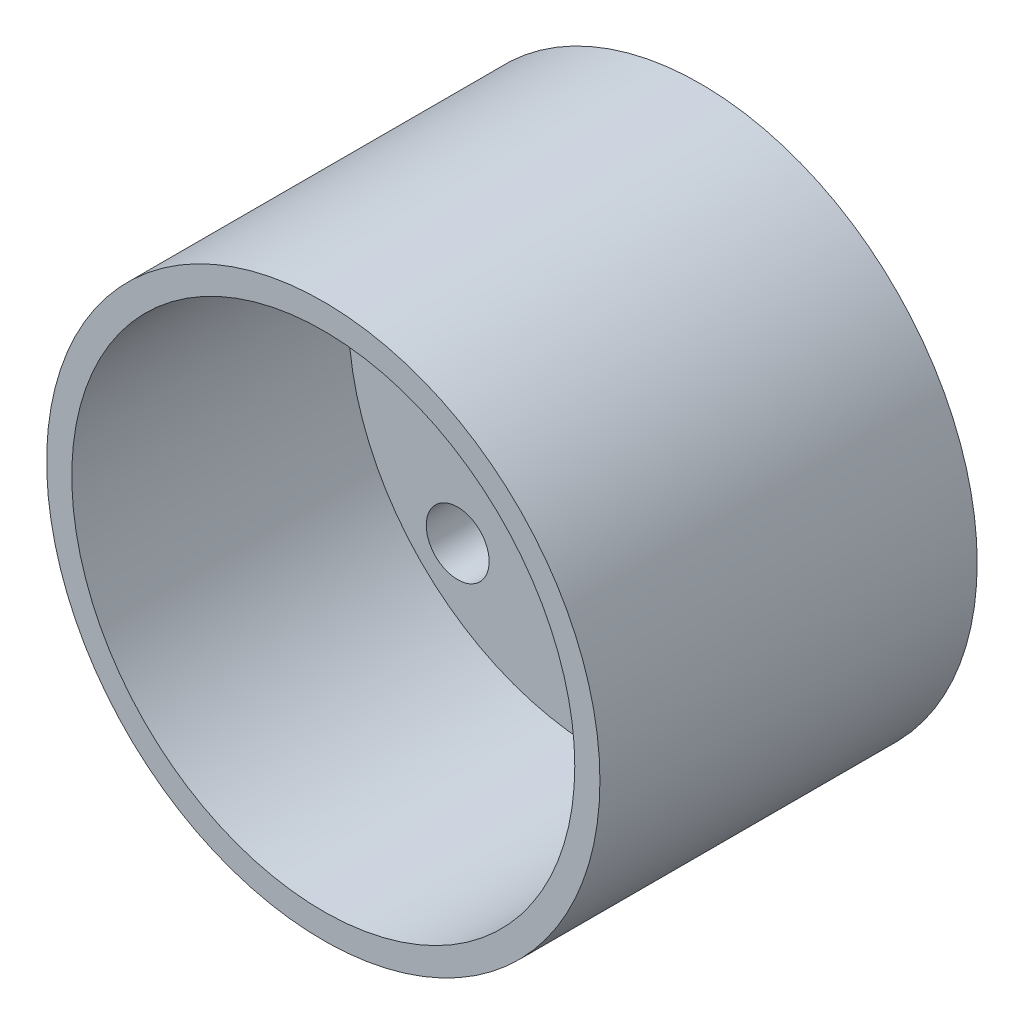
ISO-10303-21;
HEADER;
FILE_DESCRIPTION(('STEP AP214'),'2;1');
FILE_NAME('part.step','',(''),(''),'','','');
FILE_SCHEMA(('AUTOMOTIVE_DESIGN { 1 0 10303 214 1 1 1 1 }'));
ENDSEC;
DATA;
#1=APPLICATION_CONTEXT('core data for automotive mechanical design processes');
#2=APPLICATION_PROTOCOL_DEFINITION('international standard','automotive_design',2000,#1);
#3=PRODUCT_CONTEXT('',#1,'mechanical');
#4=PRODUCT('Part','Part','',(#3));
#5=PRODUCT_RELATED_PRODUCT_CATEGORY('part','',(#4));
#6=PRODUCT_DEFINITION_FORMATION('','',#4);
#7=PRODUCT_DEFINITION_CONTEXT('part definition',#1,'design');
#8=PRODUCT_DEFINITION('design','',#6,#7);
#9=PRODUCT_DEFINITION_SHAPE('','',#8);
#10=(LENGTH_UNIT() NAMED_UNIT(*) SI_UNIT(.MILLI.,.METRE.));
#11=(NAMED_UNIT(*) PLANE_ANGLE_UNIT() SI_UNIT($,.RADIAN.));
#12=(NAMED_UNIT(*) SI_UNIT($,.STERADIAN.) SOLID_ANGLE_UNIT());
#13=UNCERTAINTY_MEASURE_WITH_UNIT(LENGTH_MEASURE(1.E-05),#10,'distance_accuracy_value','');
#14=(GEOMETRIC_REPRESENTATION_CONTEXT(3) GLOBAL_UNCERTAINTY_ASSIGNED_CONTEXT((#13)) GLOBAL_UNIT_ASSIGNED_CONTEXT((#10,
#11,#12)) REPRESENTATION_CONTEXT('',''));
#15=CARTESIAN_POINT('',(0.,0.,0.));
#16=DIRECTION('',(0.,0.,1.));
#17=DIRECTION('',(1.,0.,0.));
#18=AXIS2_PLACEMENT_3D('',#15,#16,#17);
#19=CARTESIAN_POINT('',(0.,0.,15.));
#20=DIRECTION('',(0.,0.,-1.));
#21=DIRECTION('',(-1.,0.,0.));
#22=AXIS2_PLACEMENT_3D('',#19,#20,#21);
#23=CYLINDRICAL_SURFACE('',#22,11.);
#24=CARTESIAN_POINT('',(0.,0.,15.));
#25=DIRECTION('',(0.,0.,1.));
#26=DIRECTION('',(1.,0.,0.));
#27=AXIS2_PLACEMENT_3D('',#24,#25,#26);
#28=CIRCLE('',#27,11.);
#29=CARTESIAN_POINT('',(11.,0.,15.));
#30=VERTEX_POINT('',#29);
#31=EDGE_CURVE('E10',#30,#30,#28,.T.);
#32=ORIENTED_EDGE('',*,*,#31,.F.);
#33=EDGE_LOOP('',(#32));
#34=FACE_BOUND('',#33,.T.);
#35=CARTESIAN_POINT('',(0.,0.,0.));
#36=DIRECTION('',(0.,0.,1.));
#37=DIRECTION('',(1.,0.,0.));
#38=AXIS2_PLACEMENT_3D('',#35,#36,#37);
#39=CIRCLE('',#38,11.);
#40=CARTESIAN_POINT('',(11.,0.,0.));
#41=VERTEX_POINT('',#40);
#42=EDGE_CURVE('E51',#41,#41,#39,.T.);
#43=ORIENTED_EDGE('',*,*,#42,.T.);
#44=EDGE_LOOP('',(#43));
#45=FACE_BOUND('',#44,.T.);
#46=ADVANCED_FACE('F43',(#34,#45),#23,.T.);
#47=CARTESIAN_POINT('',(0.,0.,15.));
#48=DIRECTION('',(0.,0.,1.));
#49=DIRECTION('',(1.,0.,0.));
#50=AXIS2_PLACEMENT_3D('',#47,#48,#49);
#51=PLANE('',#50);
#52=CARTESIAN_POINT('',(0.,0.,15.));
#53=DIRECTION('',(0.,0.,1.));
#54=DIRECTION('',(1.,0.,0.));
#55=AXIS2_PLACEMENT_3D('',#52,#53,#54);
#56=CIRCLE('',#55,10.);
#57=CARTESIAN_POINT('',(10.,0.,15.));
#58=VERTEX_POINT('',#57);
#59=EDGE_CURVE('E60',#58,#58,#56,.T.);
#60=ORIENTED_EDGE('',*,*,#59,.F.);
#61=EDGE_LOOP('',(#60));
#62=FACE_BOUND('',#61,.T.);
#63=ORIENTED_EDGE('',*,*,#31,.T.);
#64=EDGE_LOOP('',(#63));
#65=FACE_BOUND('',#64,.T.);
#66=ADVANCED_FACE('F151',(#62,#65),#51,.T.);
#67=CARTESIAN_POINT('',(0.,0.,0.));
#68=DIRECTION('',(0.,0.,1.));
#69=DIRECTION('',(1.,0.,0.));
#70=AXIS2_PLACEMENT_3D('',#67,#68,#69);
#71=PLANE('',#70);
#72=CARTESIAN_POINT('',(0.,8.,0.));
#73=DIRECTION('',(0.,0.,-1.));
#74=DIRECTION('',(-1.,0.,0.));
#75=AXIS2_PLACEMENT_3D('',#72,#73,#74);
#76=CIRCLE('',#75,1.25);
#77=CARTESIAN_POINT('',(-1.25,8.,0.));
#78=VERTEX_POINT('',#77);
#79=EDGE_CURVE('E112',#78,#78,#76,.T.);
#80=ORIENTED_EDGE('',*,*,#79,.F.);
#81=EDGE_LOOP('',(#80));
#82=FACE_BOUND('',#81,.T.);
#83=CARTESIAN_POINT('',(-5.65685424949239,5.65685424949237,0.));
#84=DIRECTION('',(0.,0.,-1.));
#85=DIRECTION('',(-1.,0.,0.));
#86=AXIS2_PLACEMENT_3D('',#83,#84,#85);
#87=CIRCLE('',#86,1.25);
#88=CARTESIAN_POINT('',(-6.90685424949239,5.65685424949237,0.));
#89=VERTEX_POINT('',#88);
#90=EDGE_CURVE('E122',#89,#89,#87,.T.);
#91=ORIENTED_EDGE('',*,*,#90,.F.);
#92=EDGE_LOOP('',(#91));
#93=FACE_BOUND('',#92,.T.);
#94=CARTESIAN_POINT('',(-8.,0.,0.));
#95=DIRECTION('',(0.,0.,-1.));
#96=DIRECTION('',(-1.,0.,0.));
#97=AXIS2_PLACEMENT_3D('',#94,#95,#96);
#98=CIRCLE('',#97,1.25);
#99=CARTESIAN_POINT('',(-9.25,0.,0.));
#100=VERTEX_POINT('',#99);
#101=EDGE_CURVE('E117',#100,#100,#98,.T.);
#102=ORIENTED_EDGE('',*,*,#101,.F.);
#103=EDGE_LOOP('',(#102));
#104=FACE_BOUND('',#103,.T.);
#105=CARTESIAN_POINT('',(-5.65685424949235,-5.65685424949241,0.));
#106=DIRECTION('',(0.,0.,-1.));
#107=DIRECTION('',(-1.,0.,0.));
#108=AXIS2_PLACEMENT_3D('',#105,#106,#107);
#109=CIRCLE('',#108,1.25);
#110=CARTESIAN_POINT('',(-6.90685424949235,-5.65685424949241,0.));
#111=VERTEX_POINT('',#110);
#112=EDGE_CURVE('E113',#111,#111,#109,.T.);
#113=ORIENTED_EDGE('',*,*,#112,.F.);
#114=EDGE_LOOP('',(#113));
#115=FACE_BOUND('',#114,.T.);
#116=CARTESIAN_POINT('',(0.,-8.,0.));
#117=DIRECTION('',(0.,0.,-1.));
#118=DIRECTION('',(-1.,0.,0.));
#119=AXIS2_PLACEMENT_3D('',#116,#117,#118);
#120=CIRCLE('',#119,1.25);
#121=CARTESIAN_POINT('',(-1.24999999999994,-8.,0.));
#122=VERTEX_POINT('',#121);
#123=EDGE_CURVE('E118',#122,#122,#120,.T.);
#124=ORIENTED_EDGE('',*,*,#123,.F.);
#125=EDGE_LOOP('',(#124));
#126=FACE_BOUND('',#125,.T.);
#127=CARTESIAN_POINT('',(5.65685424949243,-5.65685424949233,0.));
#128=DIRECTION('',(0.,0.,-1.));
#129=DIRECTION('',(-1.,0.,0.));
#130=AXIS2_PLACEMENT_3D('',#127,#128,#129);
#131=CIRCLE('',#130,1.25);
#132=CARTESIAN_POINT('',(4.40685424949243,-5.65685424949233,0.));
#133=VERTEX_POINT('',#132);
#134=EDGE_CURVE('E137',#133,#133,#131,.T.);
#135=ORIENTED_EDGE('',*,*,#134,.F.);
#136=EDGE_LOOP('',(#135));
#137=FACE_BOUND('',#136,.T.);
#138=CARTESIAN_POINT('',(8.,0.,0.));
#139=DIRECTION('',(0.,0.,-1.));
#140=DIRECTION('',(-1.,0.,0.));
#141=AXIS2_PLACEMENT_3D('',#138,#139,#140);
#142=CIRCLE('',#141,1.25);
#143=CARTESIAN_POINT('',(6.75,0.,0.));
#144=VERTEX_POINT('',#143);
#145=EDGE_CURVE('E133',#144,#144,#142,.T.);
#146=ORIENTED_EDGE('',*,*,#145,.F.);
#147=EDGE_LOOP('',(#146));
#148=FACE_BOUND('',#147,.T.);
#149=CARTESIAN_POINT('',(5.65685424949231,5.65685424949245,0.));
#150=DIRECTION('',(0.,0.,-1.));
#151=DIRECTION('',(-1.,0.,0.));
#152=AXIS2_PLACEMENT_3D('',#149,#150,#151);
#153=CIRCLE('',#152,1.25);
#154=CARTESIAN_POINT('',(4.40685424949231,5.65685424949245,0.));
#155=VERTEX_POINT('',#154);
#156=EDGE_CURVE('E129',#155,#155,#153,.T.);
#157=ORIENTED_EDGE('',*,*,#156,.F.);
#158=EDGE_LOOP('',(#157));
#159=FACE_BOUND('',#158,.T.);
#160=CARTESIAN_POINT('',(0.,0.,0.));
#161=DIRECTION('',(0.,0.,-1.));
#162=DIRECTION('',(-1.,0.,0.));
#163=AXIS2_PLACEMENT_3D('',#160,#161,#162);
#164=CIRCLE('',#163,4.15);
#165=CARTESIAN_POINT('',(-4.15,0.,0.));
#166=VERTEX_POINT('',#165);
#167=EDGE_CURVE('E68',#166,#166,#164,.T.);
#168=ORIENTED_EDGE('',*,*,#167,.F.);
#169=EDGE_LOOP('',(#168));
#170=FACE_BOUND('',#169,.T.);
#171=ORIENTED_EDGE('',*,*,#42,.F.);
#172=EDGE_LOOP('',(#171));
#173=FACE_BOUND('',#172,.T.);
#174=ADVANCED_FACE('F147',(#82,#93,#104,#115,#126,#137,#148,#159,#170,#173),#71,.F.);
#175=CARTESIAN_POINT('',(0.,0.,4.));
#176=DIRECTION('',(0.,0.,1.));
#177=DIRECTION('',(1.,0.,0.));
#178=AXIS2_PLACEMENT_3D('',#175,#176,#177);
#179=CYLINDRICAL_SURFACE('',#178,10.);
#180=CARTESIAN_POINT('',(0.,0.,4.));
#181=DIRECTION('',(0.,0.,1.));
#182=DIRECTION('',(1.,0.,0.));
#183=AXIS2_PLACEMENT_3D('',#180,#181,#182);
#184=CIRCLE('',#183,10.);
#185=CARTESIAN_POINT('',(10.,0.,4.));
#186=VERTEX_POINT('',#185);
#187=EDGE_CURVE('E57',#186,#186,#184,.T.);
#188=ORIENTED_EDGE('',*,*,#187,.F.);
#189=EDGE_LOOP('',(#188));
#190=FACE_BOUND('',#189,.T.);
#191=ORIENTED_EDGE('',*,*,#59,.T.);
#192=EDGE_LOOP('',(#191));
#193=FACE_BOUND('',#192,.T.);
#194=ADVANCED_FACE('F150',(#190,#193),#179,.F.);
#195=CARTESIAN_POINT('',(0.,0.,4.));
#196=DIRECTION('',(0.,0.,1.));
#197=DIRECTION('',(1.,0.,0.));
#198=AXIS2_PLACEMENT_3D('',#195,#196,#197);
#199=PLANE('',#198);
#200=CARTESIAN_POINT('',(0.,8.,4.));
#201=DIRECTION('',(0.,0.,1.));
#202=DIRECTION('',(1.,0.,0.));
#203=AXIS2_PLACEMENT_3D('',#200,#201,#202);
#204=CIRCLE('',#203,1.25);
#205=CARTESIAN_POINT('',(1.25,8.,4.));
#206=VERTEX_POINT('',#205);
#207=EDGE_CURVE('E46',#206,#206,#204,.T.);
#208=ORIENTED_EDGE('',*,*,#207,.F.);
#209=EDGE_LOOP('',(#208));
#210=FACE_BOUND('',#209,.T.);
#211=CARTESIAN_POINT('',(-5.65685424949239,5.65685424949237,4.));
#212=DIRECTION('',(0.,0.,1.));
#213=DIRECTION('',(1.,0.,0.));
#214=AXIS2_PLACEMENT_3D('',#211,#212,#213);
#215=CIRCLE('',#214,1.25);
#216=CARTESIAN_POINT('',(-4.40685424949239,5.65685424949237,4.));
#217=VERTEX_POINT('',#216);
#218=EDGE_CURVE('E91',#217,#217,#215,.T.);
#219=ORIENTED_EDGE('',*,*,#218,.F.);
#220=EDGE_LOOP('',(#219));
#221=FACE_BOUND('',#220,.T.);
#222=CARTESIAN_POINT('',(-8.,0.,4.));
#223=DIRECTION('',(0.,0.,1.));
#224=DIRECTION('',(1.,0.,0.));
#225=AXIS2_PLACEMENT_3D('',#222,#223,#224);
#226=CIRCLE('',#225,1.25);
#227=CARTESIAN_POINT('',(-6.75,0.,4.));
#228=VERTEX_POINT('',#227);
#229=EDGE_CURVE('E88',#228,#228,#226,.T.);
#230=ORIENTED_EDGE('',*,*,#229,.F.);
#231=EDGE_LOOP('',(#230));
#232=FACE_BOUND('',#231,.T.);
#233=CARTESIAN_POINT('',(-5.65685424949235,-5.65685424949241,4.));
#234=DIRECTION('',(0.,0.,1.));
#235=DIRECTION('',(1.,0.,0.));
#236=AXIS2_PLACEMENT_3D('',#233,#234,#235);
#237=CIRCLE('',#236,1.25);
#238=CARTESIAN_POINT('',(-4.40685424949235,-5.65685424949241,4.));
#239=VERTEX_POINT('',#238);
#240=EDGE_CURVE('E84',#239,#239,#237,.T.);
#241=ORIENTED_EDGE('',*,*,#240,.F.);
#242=EDGE_LOOP('',(#241));
#243=FACE_BOUND('',#242,.T.);
#244=CARTESIAN_POINT('',(0.,-8.,4.));
#245=DIRECTION('',(0.,0.,1.));
#246=DIRECTION('',(1.,0.,0.));
#247=AXIS2_PLACEMENT_3D('',#244,#245,#246);
#248=CIRCLE('',#247,1.25);
#249=CARTESIAN_POINT('',(1.25000000000006,-8.,4.));
#250=VERTEX_POINT('',#249);
#251=EDGE_CURVE('E80',#250,#250,#248,.T.);
#252=ORIENTED_EDGE('',*,*,#251,.F.);
#253=EDGE_LOOP('',(#252));
#254=FACE_BOUND('',#253,.T.);
#255=CARTESIAN_POINT('',(5.65685424949243,-5.65685424949233,4.));
#256=DIRECTION('',(0.,0.,1.));
#257=DIRECTION('',(1.,0.,0.));
#258=AXIS2_PLACEMENT_3D('',#255,#256,#257);
#259=CIRCLE('',#258,1.25);
#260=CARTESIAN_POINT('',(6.90685424949243,-5.65685424949233,4.));
#261=VERTEX_POINT('',#260);
#262=EDGE_CURVE('E76',#261,#261,#259,.T.);
#263=ORIENTED_EDGE('',*,*,#262,.F.);
#264=EDGE_LOOP('',(#263));
#265=FACE_BOUND('',#264,.T.);
#266=CARTESIAN_POINT('',(8.,0.,4.));
#267=DIRECTION('',(0.,0.,1.));
#268=DIRECTION('',(1.,0.,0.));
#269=AXIS2_PLACEMENT_3D('',#266,#267,#268);
#270=CIRCLE('',#269,1.25);
#271=CARTESIAN_POINT('',(9.25,0.,4.));
#272=VERTEX_POINT('',#271);
#273=EDGE_CURVE('E72',#272,#272,#270,.T.);
#274=ORIENTED_EDGE('',*,*,#273,.F.);
#275=EDGE_LOOP('',(#274));
#276=FACE_BOUND('',#275,.T.);
#277=CARTESIAN_POINT('',(5.65685424949231,5.65685424949245,4.));
#278=DIRECTION('',(0.,0.,1.));
#279=DIRECTION('',(1.,0.,0.));
#280=AXIS2_PLACEMENT_3D('',#277,#278,#279);
#281=CIRCLE('',#280,1.25);
#282=CARTESIAN_POINT('',(6.90685424949231,5.65685424949245,4.));
#283=VERTEX_POINT('',#282);
#284=EDGE_CURVE('E67',#283,#283,#281,.T.);
#285=ORIENTED_EDGE('',*,*,#284,.F.);
#286=EDGE_LOOP('',(#285));
#287=FACE_BOUND('',#286,.T.);
#288=CARTESIAN_POINT('',(0.,0.,4.));
#289=DIRECTION('',(0.,0.,1.));
#290=DIRECTION('',(1.,0.,0.));
#291=AXIS2_PLACEMENT_3D('',#288,#289,#290);
#292=CIRCLE('',#291,4.15);
#293=CARTESIAN_POINT('',(4.15,0.,4.));
#294=VERTEX_POINT('',#293);
#295=EDGE_CURVE('E63',#294,#294,#292,.T.);
#296=ORIENTED_EDGE('',*,*,#295,.F.);
#297=EDGE_LOOP('',(#296));
#298=FACE_BOUND('',#297,.T.);
#299=ORIENTED_EDGE('',*,*,#187,.T.);
#300=EDGE_LOOP('',(#299));
#301=FACE_BOUND('',#300,.T.);
#302=ADVANCED_FACE('F175',(#210,#221,#232,#243,#254,#265,#276,#287,#298,#301),#199,.T.);
#303=CARTESIAN_POINT('',(0.,0.,11.));
#304=DIRECTION('',(0.,0.,-1.));
#305=DIRECTION('',(-1.,0.,0.));
#306=AXIS2_PLACEMENT_3D('',#303,#304,#305);
#307=CYLINDRICAL_SURFACE('',#306,4.15);
#308=ORIENTED_EDGE('',*,*,#295,.T.);
#309=EDGE_LOOP('',(#308));
#310=FACE_BOUND('',#309,.T.);
#311=ORIENTED_EDGE('',*,*,#167,.T.);
#312=EDGE_LOOP('',(#311));
#313=FACE_BOUND('',#312,.T.);
#314=ADVANCED_FACE('F179',(#310,#313),#307,.F.);
#315=CARTESIAN_POINT('',(5.65685424949231,5.65685424949245,11.));
#316=DIRECTION('',(0.,0.,-1.));
#317=DIRECTION('',(-1.,0.,0.));
#318=AXIS2_PLACEMENT_3D('',#315,#316,#317);
#319=CYLINDRICAL_SURFACE('',#318,1.25);
#320=ORIENTED_EDGE('',*,*,#284,.T.);
#321=EDGE_LOOP('',(#320));
#322=FACE_BOUND('',#321,.T.);
#323=ORIENTED_EDGE('',*,*,#156,.T.);
#324=EDGE_LOOP('',(#323));
#325=FACE_BOUND('',#324,.T.);
#326=ADVANCED_FACE('F183',(#322,#325),#319,.F.);
#327=CARTESIAN_POINT('',(8.,0.,11.));
#328=DIRECTION('',(0.,0.,-1.));
#329=DIRECTION('',(-1.,0.,0.));
#330=AXIS2_PLACEMENT_3D('',#327,#328,#329);
#331=CYLINDRICAL_SURFACE('',#330,1.25);
#332=ORIENTED_EDGE('',*,*,#273,.T.);
#333=EDGE_LOOP('',(#332));
#334=FACE_BOUND('',#333,.T.);
#335=ORIENTED_EDGE('',*,*,#145,.T.);
#336=EDGE_LOOP('',(#335));
#337=FACE_BOUND('',#336,.T.);
#338=ADVANCED_FACE('F201',(#334,#337),#331,.F.);
#339=CARTESIAN_POINT('',(5.65685424949243,-5.65685424949233,11.));
#340=DIRECTION('',(0.,0.,-1.));
#341=DIRECTION('',(-1.,0.,0.));
#342=AXIS2_PLACEMENT_3D('',#339,#340,#341);
#343=CYLINDRICAL_SURFACE('',#342,1.25);
#344=ORIENTED_EDGE('',*,*,#262,.T.);
#345=EDGE_LOOP('',(#344));
#346=FACE_BOUND('',#345,.T.);
#347=ORIENTED_EDGE('',*,*,#134,.T.);
#348=EDGE_LOOP('',(#347));
#349=FACE_BOUND('',#348,.T.);
#350=ADVANCED_FACE('F205',(#346,#349),#343,.F.);
#351=CARTESIAN_POINT('',(0.,-8.,11.));
#352=DIRECTION('',(0.,0.,-1.));
#353=DIRECTION('',(-1.,0.,0.));
#354=AXIS2_PLACEMENT_3D('',#351,#352,#353);
#355=CYLINDRICAL_SURFACE('',#354,1.25);
#356=ORIENTED_EDGE('',*,*,#251,.T.);
#357=EDGE_LOOP('',(#356));
#358=FACE_BOUND('',#357,.T.);
#359=ORIENTED_EDGE('',*,*,#123,.T.);
#360=EDGE_LOOP('',(#359));
#361=FACE_BOUND('',#360,.T.);
#362=ADVANCED_FACE('F145',(#358,#361),#355,.F.);
#363=CARTESIAN_POINT('',(-5.65685424949235,-5.65685424949241,11.));
#364=DIRECTION('',(0.,0.,-1.));
#365=DIRECTION('',(-1.,0.,0.));
#366=AXIS2_PLACEMENT_3D('',#363,#364,#365);
#367=CYLINDRICAL_SURFACE('',#366,1.25);
#368=ORIENTED_EDGE('',*,*,#240,.T.);
#369=EDGE_LOOP('',(#368));
#370=FACE_BOUND('',#369,.T.);
#371=ORIENTED_EDGE('',*,*,#112,.T.);
#372=EDGE_LOOP('',(#371));
#373=FACE_BOUND('',#372,.T.);
#374=ADVANCED_FACE('F185',(#370,#373),#367,.F.);
#375=CARTESIAN_POINT('',(-8.,0.,11.));
#376=DIRECTION('',(0.,0.,-1.));
#377=DIRECTION('',(-1.,0.,0.));
#378=AXIS2_PLACEMENT_3D('',#375,#376,#377);
#379=CYLINDRICAL_SURFACE('',#378,1.25);
#380=ORIENTED_EDGE('',*,*,#229,.T.);
#381=EDGE_LOOP('',(#380));
#382=FACE_BOUND('',#381,.T.);
#383=ORIENTED_EDGE('',*,*,#101,.T.);
#384=EDGE_LOOP('',(#383));
#385=FACE_BOUND('',#384,.T.);
#386=ADVANCED_FACE('F188',(#382,#385),#379,.F.);
#387=CARTESIAN_POINT('',(-5.65685424949239,5.65685424949237,11.));
#388=DIRECTION('',(0.,0.,-1.));
#389=DIRECTION('',(-1.,0.,0.));
#390=AXIS2_PLACEMENT_3D('',#387,#388,#389);
#391=CYLINDRICAL_SURFACE('',#390,1.25);
#392=ORIENTED_EDGE('',*,*,#218,.T.);
#393=EDGE_LOOP('',(#392));
#394=FACE_BOUND('',#393,.T.);
#395=ORIENTED_EDGE('',*,*,#90,.T.);
#396=EDGE_LOOP('',(#395));
#397=FACE_BOUND('',#396,.T.);
#398=ADVANCED_FACE('F192',(#394,#397),#391,.F.);
#399=CARTESIAN_POINT('',(0.,8.,11.));
#400=DIRECTION('',(0.,0.,-1.));
#401=DIRECTION('',(-1.,0.,0.));
#402=AXIS2_PLACEMENT_3D('',#399,#400,#401);
#403=CYLINDRICAL_SURFACE('',#402,1.25);
#404=ORIENTED_EDGE('',*,*,#207,.T.);
#405=EDGE_LOOP('',(#404));
#406=FACE_BOUND('',#405,.T.);
#407=ORIENTED_EDGE('',*,*,#79,.T.);
#408=EDGE_LOOP('',(#407));
#409=FACE_BOUND('',#408,.T.);
#410=ADVANCED_FACE('F196',(#406,#409),#403,.F.);
#411=CLOSED_SHELL('',(#46,#66,#174,#194,#302,#314,#326,#338,#350,#362,#374,#386,#398,#410));
#412=MANIFOLD_SOLID_BREP('B2',#411);
#413=ADVANCED_BREP_SHAPE_REPRESENTATION('',(#18,#412),#14);
#414=SHAPE_DEFINITION_REPRESENTATION(#9,#413);
ENDSEC;
END-ISO-10303-21;
